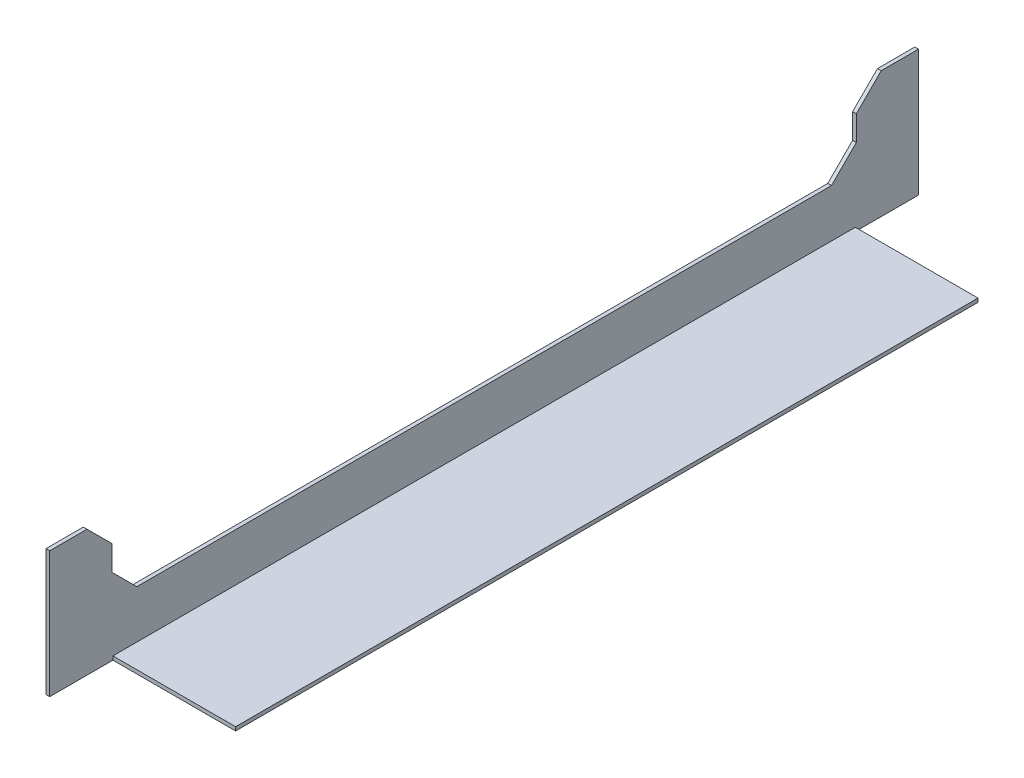
ISO-10303-21;
HEADER;
FILE_DESCRIPTION(('STEP AP214'),'2;1');
FILE_NAME('part.step','',(''),(''),'','','');
FILE_SCHEMA(('AUTOMOTIVE_DESIGN { 1 0 10303 214 1 1 1 1 }'));
ENDSEC;
DATA;
#1=APPLICATION_CONTEXT('core data for automotive mechanical design processes');
#2=APPLICATION_PROTOCOL_DEFINITION('international standard','automotive_design',2000,#1);
#3=PRODUCT_CONTEXT('',#1,'mechanical');
#4=PRODUCT('Part','Part','',(#3));
#5=PRODUCT_RELATED_PRODUCT_CATEGORY('part','',(#4));
#6=PRODUCT_DEFINITION_FORMATION('','',#4);
#7=PRODUCT_DEFINITION_CONTEXT('part definition',#1,'design');
#8=PRODUCT_DEFINITION('design','',#6,#7);
#9=PRODUCT_DEFINITION_SHAPE('','',#8);
#10=(LENGTH_UNIT() NAMED_UNIT(*) SI_UNIT(.MILLI.,.METRE.));
#11=(NAMED_UNIT(*) PLANE_ANGLE_UNIT() SI_UNIT($,.RADIAN.));
#12=(NAMED_UNIT(*) SI_UNIT($,.STERADIAN.) SOLID_ANGLE_UNIT());
#13=UNCERTAINTY_MEASURE_WITH_UNIT(LENGTH_MEASURE(1.E-05),#10,'distance_accuracy_value','');
#14=(GEOMETRIC_REPRESENTATION_CONTEXT(3) GLOBAL_UNCERTAINTY_ASSIGNED_CONTEXT((#13)) GLOBAL_UNIT_ASSIGNED_CONTEXT((#10,
#11,#12)) REPRESENTATION_CONTEXT('',''));
#15=CARTESIAN_POINT('',(0.,0.,0.));
#16=DIRECTION('',(0.,0.,1.));
#17=DIRECTION('',(1.,0.,0.));
#18=AXIS2_PLACEMENT_3D('',#15,#16,#17);
#19=CARTESIAN_POINT('',(1.50000000000006,50.8,349.2));
#20=DIRECTION('',(0.,-1.,0.));
#21=DIRECTION('',(0.,0.,-1.));
#22=AXIS2_PLACEMENT_3D('',#19,#20,#21);
#23=PLANE('',#22);
#24=DIRECTION('',(0.,0.,-1.));
#25=VECTOR('',#24,1.);
#26=CARTESIAN_POINT('',(1.50000000000006,50.8,349.2));
#27=LINE('',#26,#25);
#28=CARTESIAN_POINT('',(1.50000000000006,50.8,349.2));
#29=VERTEX_POINT('',#28);
#30=CARTESIAN_POINT('',(1.49999999999995,50.8,334.2));
#31=VERTEX_POINT('',#30);
#32=EDGE_CURVE('E180',#29,#31,#27,.T.);
#33=ORIENTED_EDGE('',*,*,#32,.T.);
#34=DIRECTION('',(-1.,0.,0.));
#35=VECTOR('',#34,1.);
#36=CARTESIAN_POINT('',(1.49999999999995,50.8,334.2));
#37=LINE('',#36,#35);
#38=CARTESIAN_POINT('',(0.,50.8,334.2));
#39=VERTEX_POINT('',#38);
#40=EDGE_CURVE('E202',#31,#39,#37,.T.);
#41=ORIENTED_EDGE('',*,*,#40,.T.);
#42=DIRECTION('',(0.,0.,-1.));
#43=VECTOR('',#42,1.);
#44=CARTESIAN_POINT('',(0.,50.8,349.2));
#45=LINE('',#44,#43);
#46=CARTESIAN_POINT('',(0.,50.8,349.2));
#47=VERTEX_POINT('',#46);
#48=EDGE_CURVE('E281',#47,#39,#45,.T.);
#49=ORIENTED_EDGE('',*,*,#48,.F.);
#50=DIRECTION('',(-1.,0.,0.));
#51=VECTOR('',#50,1.);
#52=CARTESIAN_POINT('',(1.50000000000006,50.8,349.2));
#53=LINE('',#52,#51);
#54=EDGE_CURVE('E264',#29,#47,#53,.T.);
#55=ORIENTED_EDGE('',*,*,#54,.F.);
#56=EDGE_LOOP('',(#33,#41,#49,#55));
#57=FACE_BOUND('',#56,.T.);
#58=ADVANCED_FACE('F36',(#57),#23,.F.);
#59=CARTESIAN_POINT('',(0.,0.,349.2));
#60=DIRECTION('',(0.,1.,0.));
#61=DIRECTION('',(0.,0.,1.));
#62=AXIS2_PLACEMENT_3D('',#59,#60,#61);
#63=PLANE('',#62);
#64=DIRECTION('',(-1.,0.,0.));
#65=VECTOR('',#64,1.);
#66=CARTESIAN_POINT('',(4.44089209850063E-13,0.,323.8));
#67=LINE('',#66,#65);
#68=CARTESIAN_POINT('',(50.8000000000004,0.,323.8));
#69=VERTEX_POINT('',#68);
#70=CARTESIAN_POINT('',(1.50000000000039,0.,323.8));
#71=VERTEX_POINT('',#70);
#72=EDGE_CURVE('E158',#69,#71,#67,.T.);
#73=ORIENTED_EDGE('',*,*,#72,.T.);
#74=DIRECTION('',(0.,0.,1.));
#75=VECTOR('',#74,1.);
#76=CARTESIAN_POINT('',(1.49999999999995,0.,349.2));
#77=LINE('',#76,#75);
#78=CARTESIAN_POINT('',(1.49999999999995,0.,349.2));
#79=VERTEX_POINT('',#78);
#80=EDGE_CURVE('E240',#71,#79,#77,.T.);
#81=ORIENTED_EDGE('',*,*,#80,.T.);
#82=DIRECTION('',(1.,0.,0.));
#83=VECTOR('',#82,1.);
#84=CARTESIAN_POINT('',(0.,0.,349.2));
#85=LINE('',#84,#83);
#86=CARTESIAN_POINT('',(0.,0.,349.2));
#87=VERTEX_POINT('',#86);
#88=EDGE_CURVE('E258',#87,#79,#85,.T.);
#89=ORIENTED_EDGE('',*,*,#88,.F.);
#90=DIRECTION('',(0.,0.,-1.));
#91=VECTOR('',#90,1.);
#92=CARTESIAN_POINT('',(0.,0.,349.2));
#93=LINE('',#92,#91);
#94=CARTESIAN_POINT('',(0.,0.,0.));
#95=VERTEX_POINT('',#94);
#96=EDGE_CURVE('E268',#87,#95,#93,.T.);
#97=ORIENTED_EDGE('',*,*,#96,.T.);
#98=DIRECTION('',(1.,0.,0.));
#99=VECTOR('',#98,1.);
#100=CARTESIAN_POINT('',(0.,0.,0.));
#101=LINE('',#100,#99);
#102=CARTESIAN_POINT('',(1.49999999999995,0.,2.22044604925031E-13));
#103=VERTEX_POINT('',#102);
#104=EDGE_CURVE('E257',#95,#103,#101,.T.);
#105=ORIENTED_EDGE('',*,*,#104,.T.);
#106=DIRECTION('',(0.,0.,1.));
#107=VECTOR('',#106,1.);
#108=CARTESIAN_POINT('',(1.50000000000006,0.,349.2));
#109=LINE('',#108,#107);
#110=CARTESIAN_POINT('',(1.50000000000006,0.,25.4000000000002));
#111=VERTEX_POINT('',#110);
#112=EDGE_CURVE('E249',#103,#111,#109,.T.);
#113=ORIENTED_EDGE('',*,*,#112,.T.);
#114=DIRECTION('',(1.,0.,0.));
#115=VECTOR('',#114,1.);
#116=CARTESIAN_POINT('',(0.,0.,25.4));
#117=LINE('',#116,#115);
#118=CARTESIAN_POINT('',(50.8000000000001,0.,25.4));
#119=VERTEX_POINT('',#118);
#120=EDGE_CURVE('E254',#111,#119,#117,.T.);
#121=ORIENTED_EDGE('',*,*,#120,.T.);
#122=DIRECTION('',(0.,0.,-1.));
#123=VECTOR('',#122,1.);
#124=CARTESIAN_POINT('',(50.8,0.,349.2));
#125=LINE('',#124,#123);
#126=EDGE_CURVE('E176',#69,#119,#125,.T.);
#127=ORIENTED_EDGE('',*,*,#126,.F.);
#128=EDGE_LOOP('',(#73,#81,#89,#97,#105,#113,#121,#127));
#129=FACE_BOUND('',#128,.T.);
#130=ADVANCED_FACE('F303',(#129),#63,.F.);
#131=CARTESIAN_POINT('',(50.8,1.5,349.2));
#132=DIRECTION('',(-1.,0.,0.));
#133=DIRECTION('',(0.,0.,1.));
#134=AXIS2_PLACEMENT_3D('',#131,#132,#133);
#135=PLANE('',#134);
#136=DIRECTION('',(0.,0.,-1.));
#137=VECTOR('',#136,1.);
#138=CARTESIAN_POINT('',(50.8,1.5,349.2));
#139=LINE('',#138,#137);
#140=CARTESIAN_POINT('',(50.8,1.5,323.8));
#141=VERTEX_POINT('',#140);
#142=CARTESIAN_POINT('',(50.8000000000002,1.5,25.4));
#143=VERTEX_POINT('',#142);
#144=EDGE_CURVE('E167',#141,#143,#139,.T.);
#145=ORIENTED_EDGE('',*,*,#144,.F.);
#146=DIRECTION('',(0.,1.,0.));
#147=VECTOR('',#146,1.);
#148=CARTESIAN_POINT('',(50.8000000000002,-0.5,323.8));
#149=LINE('',#148,#147);
#150=EDGE_CURVE('E151',#69,#141,#149,.T.);
#151=ORIENTED_EDGE('',*,*,#150,.F.);
#152=ORIENTED_EDGE('',*,*,#126,.T.);
#153=DIRECTION('',(0.,1.,0.));
#154=VECTOR('',#153,1.);
#155=CARTESIAN_POINT('',(50.8000000000001,-0.5,25.4));
#156=LINE('',#155,#154);
#157=EDGE_CURVE('E175',#119,#143,#156,.T.);
#158=ORIENTED_EDGE('',*,*,#157,.T.);
#159=EDGE_LOOP('',(#145,#151,#152,#158));
#160=FACE_BOUND('',#159,.T.);
#161=ADVANCED_FACE('F173',(#160),#135,.F.);
#162=CARTESIAN_POINT('',(1.50000000000006,1.5,349.2));
#163=DIRECTION('',(0.,-1.,0.));
#164=DIRECTION('',(0.,0.,-1.));
#165=AXIS2_PLACEMENT_3D('',#162,#163,#164);
#166=PLANE('',#165);
#167=DIRECTION('',(0.,0.,-1.));
#168=VECTOR('',#167,1.);
#169=CARTESIAN_POINT('',(1.50000000000006,1.5,349.2));
#170=LINE('',#169,#168);
#171=CARTESIAN_POINT('',(1.49999999999995,1.5,323.8));
#172=VERTEX_POINT('',#171);
#173=CARTESIAN_POINT('',(1.50000000000006,1.5,25.4000000000002));
#174=VERTEX_POINT('',#173);
#175=EDGE_CURVE('E169',#172,#174,#170,.T.);
#176=ORIENTED_EDGE('',*,*,#175,.F.);
#177=DIRECTION('',(-1.,0.,0.));
#178=VECTOR('',#177,1.);
#179=CARTESIAN_POINT('',(1.49999999999995,1.5,323.8));
#180=LINE('',#179,#178);
#181=EDGE_CURVE('E155',#141,#172,#180,.T.);
#182=ORIENTED_EDGE('',*,*,#181,.F.);
#183=ORIENTED_EDGE('',*,*,#144,.T.);
#184=DIRECTION('',(1.,0.,0.));
#185=VECTOR('',#184,1.);
#186=CARTESIAN_POINT('',(1.50000000000006,1.5,25.4000000000002));
#187=LINE('',#186,#185);
#188=EDGE_CURVE('E245',#174,#143,#187,.T.);
#189=ORIENTED_EDGE('',*,*,#188,.F.);
#190=EDGE_LOOP('',(#176,#182,#183,#189));
#191=FACE_BOUND('',#190,.T.);
#192=ADVANCED_FACE('F165',(#191),#166,.F.);
#193=CARTESIAN_POINT('',(1.50000000000006,1.5,349.2));
#194=DIRECTION('',(-1.,0.,0.));
#195=DIRECTION('',(0.,0.,1.));
#196=AXIS2_PLACEMENT_3D('',#193,#194,#195);
#197=PLANE('',#196);
#198=CARTESIAN_POINT('',(1.50000000000039,50.8,15.0000000000002));
#199=VERTEX_POINT('',#198);
#200=CARTESIAN_POINT('',(1.50000000000006,50.8,2.22044604925031E-13));
#201=VERTEX_POINT('',#200);
#202=EDGE_CURVE('E283',#199,#201,#27,.T.);
#203=ORIENTED_EDGE('',*,*,#202,.F.);
#204=DIRECTION('',(0.,0.707106781186548,-0.707106781186548));
#205=VECTOR('',#204,1.);
#206=CARTESIAN_POINT('',(1.49999999999995,40.7999999999999,25.0000000000002));
#207=LINE('',#206,#205);
#208=CARTESIAN_POINT('',(1.49999999999995,40.7999999999999,25.0000000000002));
#209=VERTEX_POINT('',#208);
#210=EDGE_CURVE('E195',#199,#209,#207,.F.);
#211=ORIENTED_EDGE('',*,*,#210,.T.);
#212=DIRECTION('',(0.,-1.,0.));
#213=VECTOR('',#212,1.);
#214=CARTESIAN_POINT('',(1.50000000000006,1.5,25.0000000000002));
#215=LINE('',#214,#213);
#216=CARTESIAN_POINT('',(1.50000000000006,30.8,25.0000000000002));
#217=VERTEX_POINT('',#216);
#218=EDGE_CURVE('E236',#209,#217,#215,.T.);
#219=ORIENTED_EDGE('',*,*,#218,.T.);
#220=DIRECTION('',(0.,0.707106781186544,-0.707106781186551));
#221=VECTOR('',#220,1.);
#222=CARTESIAN_POINT('',(1.49999999999995,-145.95,201.750000000002));
#223=LINE('',#222,#221);
#224=CARTESIAN_POINT('',(1.50000000000039,20.8,35.0000000000003));
#225=VERTEX_POINT('',#224);
#226=EDGE_CURVE('E211',#217,#225,#223,.F.);
#227=ORIENTED_EDGE('',*,*,#226,.T.);
#228=DIRECTION('',(0.,0.,1.));
#229=VECTOR('',#228,1.);
#230=CARTESIAN_POINT('',(1.50000000000006,20.8,349.2));
#231=LINE('',#230,#229);
#232=CARTESIAN_POINT('',(1.49999999999995,20.8,314.2));
#233=VERTEX_POINT('',#232);
#234=EDGE_CURVE('E233',#225,#233,#231,.T.);
#235=ORIENTED_EDGE('',*,*,#234,.T.);
#236=DIRECTION('',(0.,-0.707106781186551,-0.707106781186544));
#237=VECTOR('',#236,1.);
#238=CARTESIAN_POINT('',(1.50000000000006,28.6499999999999,322.05));
#239=LINE('',#238,#237);
#240=CARTESIAN_POINT('',(1.50000000000039,30.8000000000002,324.2));
#241=VERTEX_POINT('',#240);
#242=EDGE_CURVE('E11',#233,#241,#239,.F.);
#243=ORIENTED_EDGE('',*,*,#242,.T.);
#244=DIRECTION('',(0.,1.,0.));
#245=VECTOR('',#244,1.);
#246=CARTESIAN_POINT('',(1.49999999999995,1.5,324.2));
#247=LINE('',#246,#245);
#248=CARTESIAN_POINT('',(1.50000000000006,40.7999999999999,324.2));
#249=VERTEX_POINT('',#248);
#250=EDGE_CURVE('E170',#241,#249,#247,.T.);
#251=ORIENTED_EDGE('',*,*,#250,.T.);
#252=DIRECTION('',(0.,-0.707106781186549,-0.707106781186546));
#253=VECTOR('',#252,1.);
#254=CARTESIAN_POINT('',(1.49999999999995,50.8,334.2));
#255=LINE('',#254,#253);
#256=EDGE_CURVE('E51',#249,#31,#255,.F.);
#257=ORIENTED_EDGE('',*,*,#256,.T.);
#258=ORIENTED_EDGE('',*,*,#32,.F.);
#259=DIRECTION('',(0.,1.,0.));
#260=VECTOR('',#259,1.);
#261=CARTESIAN_POINT('',(1.50000000000006,1.5,349.2));
#262=LINE('',#261,#260);
#263=EDGE_CURVE('E261',#79,#29,#262,.T.);
#264=ORIENTED_EDGE('',*,*,#263,.F.);
#265=ORIENTED_EDGE('',*,*,#80,.F.);
#266=DIRECTION('',(0.,1.,0.));
#267=VECTOR('',#266,1.);
#268=CARTESIAN_POINT('',(1.50000000000039,-0.5,323.8));
#269=LINE('',#268,#267);
#270=EDGE_CURVE('E162',#71,#172,#269,.T.);
#271=ORIENTED_EDGE('',*,*,#270,.T.);
#272=ORIENTED_EDGE('',*,*,#175,.T.);
#273=DIRECTION('',(0.,1.,0.));
#274=VECTOR('',#273,1.);
#275=CARTESIAN_POINT('',(1.50000000000006,-0.5,25.4000000000002));
#276=LINE('',#275,#274);
#277=EDGE_CURVE('E247',#111,#174,#276,.T.);
#278=ORIENTED_EDGE('',*,*,#277,.F.);
#279=ORIENTED_EDGE('',*,*,#112,.F.);
#280=DIRECTION('',(0.,1.,0.));
#281=VECTOR('',#280,1.);
#282=CARTESIAN_POINT('',(1.50000000000006,1.5,2.22044604925031E-13));
#283=LINE('',#282,#281);
#284=EDGE_CURVE('E271',#103,#201,#283,.T.);
#285=ORIENTED_EDGE('',*,*,#284,.T.);
#286=EDGE_LOOP('',(#203,#211,#219,#227,#235,#243,#251,#257,#258,#264,#265,#271,#272,#278,#279,#285));
#287=FACE_BOUND('',#286,.T.);
#288=ADVANCED_FACE('F232',(#287),#197,.F.);
#289=CARTESIAN_POINT('',(4.44089209850063E-13,50.8,15.));
#290=VERTEX_POINT('',#289);
#291=CARTESIAN_POINT('',(0.,50.8,0.));
#292=VERTEX_POINT('',#291);
#293=EDGE_CURVE('E280',#290,#292,#45,.T.);
#294=ORIENTED_EDGE('',*,*,#293,.F.);
#295=DIRECTION('',(1.,0.,0.));
#296=VECTOR('',#295,1.);
#297=CARTESIAN_POINT('',(1.50000000000039,50.8,15.0000000000002));
#298=LINE('',#297,#296);
#299=EDGE_CURVE('E192',#290,#199,#298,.T.);
#300=ORIENTED_EDGE('',*,*,#299,.T.);
#301=ORIENTED_EDGE('',*,*,#202,.T.);
#302=DIRECTION('',(-1.,0.,0.));
#303=VECTOR('',#302,1.);
#304=CARTESIAN_POINT('',(1.50000000000006,50.8,2.22044604925031E-13));
#305=LINE('',#304,#303);
#306=EDGE_CURVE('E274',#201,#292,#305,.T.);
#307=ORIENTED_EDGE('',*,*,#306,.T.);
#308=EDGE_LOOP('',(#294,#300,#301,#307));
#309=FACE_BOUND('',#308,.T.);
#310=ADVANCED_FACE('F289',(#309),#23,.F.);
#311=CARTESIAN_POINT('',(0.,0.,349.2));
#312=DIRECTION('',(1.,0.,0.));
#313=DIRECTION('',(0.,0.,-1.));
#314=AXIS2_PLACEMENT_3D('',#311,#312,#313);
#315=PLANE('',#314);
#316=DIRECTION('',(0.,-1.,0.));
#317=VECTOR('',#316,1.);
#318=CARTESIAN_POINT('',(4.44089209850063E-13,50.8,25.));
#319=LINE('',#318,#317);
#320=CARTESIAN_POINT('',(0.,40.7999999999999,25.));
#321=VERTEX_POINT('',#320);
#322=CARTESIAN_POINT('',(0.,30.8,25.));
#323=VERTEX_POINT('',#322);
#324=EDGE_CURVE('E228',#321,#323,#319,.T.);
#325=ORIENTED_EDGE('',*,*,#324,.F.);
#326=DIRECTION('',(0.,-0.707106781186548,0.707106781186548));
#327=VECTOR('',#326,1.);
#328=CARTESIAN_POINT('',(0.,40.7999999999999,25.));
#329=LINE('',#328,#327);
#330=EDGE_CURVE('E190',#321,#290,#329,.F.);
#331=ORIENTED_EDGE('',*,*,#330,.T.);
#332=ORIENTED_EDGE('',*,*,#293,.T.);
#333=DIRECTION('',(0.,-1.,0.));
#334=VECTOR('',#333,1.);
#335=CARTESIAN_POINT('',(0.,0.,0.));
#336=LINE('',#335,#334);
#337=EDGE_CURVE('E262',#292,#95,#336,.T.);
#338=ORIENTED_EDGE('',*,*,#337,.T.);
#339=ORIENTED_EDGE('',*,*,#96,.F.);
#340=DIRECTION('',(0.,-1.,0.));
#341=VECTOR('',#340,1.);
#342=CARTESIAN_POINT('',(0.,0.,349.2));
#343=LINE('',#342,#341);
#344=EDGE_CURVE('E266',#47,#87,#343,.T.);
#345=ORIENTED_EDGE('',*,*,#344,.F.);
#346=ORIENTED_EDGE('',*,*,#48,.T.);
#347=DIRECTION('',(0.,0.707106781186549,0.707106781186546));
#348=VECTOR('',#347,1.);
#349=CARTESIAN_POINT('',(0.,50.8,334.2));
#350=LINE('',#349,#348);
#351=CARTESIAN_POINT('',(0.,40.7999999999999,324.2));
#352=VERTEX_POINT('',#351);
#353=EDGE_CURVE('E188',#39,#352,#350,.F.);
#354=ORIENTED_EDGE('',*,*,#353,.T.);
#355=DIRECTION('',(0.,1.,0.));
#356=VECTOR('',#355,1.);
#357=CARTESIAN_POINT('',(0.,50.8,324.2));
#358=LINE('',#357,#356);
#359=CARTESIAN_POINT('',(4.44089209850063E-13,30.8000000000002,324.2));
#360=VERTEX_POINT('',#359);
#361=EDGE_CURVE('E219',#360,#352,#358,.T.);
#362=ORIENTED_EDGE('',*,*,#361,.F.);
#363=DIRECTION('',(0.,0.707106781186551,0.707106781186544));
#364=VECTOR('',#363,1.);
#365=CARTESIAN_POINT('',(0.,27.8999999999999,321.3));
#366=LINE('',#365,#364);
#367=CARTESIAN_POINT('',(0.,20.8,314.2));
#368=VERTEX_POINT('',#367);
#369=EDGE_CURVE('E44',#360,#368,#366,.F.);
#370=ORIENTED_EDGE('',*,*,#369,.T.);
#371=DIRECTION('',(0.,0.,1.));
#372=VECTOR('',#371,1.);
#373=CARTESIAN_POINT('',(0.,20.8,324.2));
#374=LINE('',#373,#372);
#375=CARTESIAN_POINT('',(4.44089209850063E-13,20.8,35.0000000000001));
#376=VERTEX_POINT('',#375);
#377=EDGE_CURVE('E218',#376,#368,#374,.T.);
#378=ORIENTED_EDGE('',*,*,#377,.F.);
#379=DIRECTION('',(0.,-0.707106781186544,0.707106781186551));
#380=VECTOR('',#379,1.);
#381=CARTESIAN_POINT('',(0.,-146.7,202.500000000002));
#382=LINE('',#381,#380);
#383=EDGE_CURVE('E209',#376,#323,#382,.F.);
#384=ORIENTED_EDGE('',*,*,#383,.T.);
#385=EDGE_LOOP('',(#325,#331,#332,#338,#339,#345,#346,#354,#362,#370,#378,#384));
#386=FACE_BOUND('',#385,.T.);
#387=ADVANCED_FACE('F217',(#386),#315,.F.);
#388=CARTESIAN_POINT('',(0.,0.,349.2));
#389=DIRECTION('',(0.,0.,-1.));
#390=DIRECTION('',(-1.,0.,0.));
#391=AXIS2_PLACEMENT_3D('',#388,#389,#390);
#392=PLANE('',#391);
#393=ORIENTED_EDGE('',*,*,#88,.T.);
#394=ORIENTED_EDGE('',*,*,#263,.T.);
#395=ORIENTED_EDGE('',*,*,#54,.T.);
#396=ORIENTED_EDGE('',*,*,#344,.T.);
#397=EDGE_LOOP('',(#393,#394,#395,#396));
#398=FACE_BOUND('',#397,.T.);
#399=ADVANCED_FACE('F305',(#398),#392,.F.);
#400=CARTESIAN_POINT('',(0.,0.,0.));
#401=DIRECTION('',(0.,0.,-1.));
#402=DIRECTION('',(-1.,0.,0.));
#403=AXIS2_PLACEMENT_3D('',#400,#401,#402);
#404=PLANE('',#403);
#405=ORIENTED_EDGE('',*,*,#284,.F.);
#406=ORIENTED_EDGE('',*,*,#104,.F.);
#407=ORIENTED_EDGE('',*,*,#337,.F.);
#408=ORIENTED_EDGE('',*,*,#306,.F.);
#409=EDGE_LOOP('',(#405,#406,#407,#408));
#410=FACE_BOUND('',#409,.T.);
#411=ADVANCED_FACE('F298',(#410),#404,.T.);
#412=CARTESIAN_POINT('',(1.50000000000006,-0.5,25.4000000000002));
#413=DIRECTION('',(0.,0.,1.));
#414=DIRECTION('',(1.,0.,0.));
#415=AXIS2_PLACEMENT_3D('',#412,#413,#414);
#416=PLANE('',#415);
#417=ORIENTED_EDGE('',*,*,#277,.T.);
#418=ORIENTED_EDGE('',*,*,#188,.T.);
#419=ORIENTED_EDGE('',*,*,#157,.F.);
#420=ORIENTED_EDGE('',*,*,#120,.F.);
#421=EDGE_LOOP('',(#417,#418,#419,#420));
#422=FACE_BOUND('',#421,.T.);
#423=ADVANCED_FACE('F362',(#422),#416,.F.);
#424=CARTESIAN_POINT('',(1.50000000000039,-0.5,323.8));
#425=DIRECTION('',(0.,0.,-1.));
#426=DIRECTION('',(-1.,0.,0.));
#427=AXIS2_PLACEMENT_3D('',#424,#425,#426);
#428=PLANE('',#427);
#429=ORIENTED_EDGE('',*,*,#150,.T.);
#430=ORIENTED_EDGE('',*,*,#181,.T.);
#431=ORIENTED_EDGE('',*,*,#270,.F.);
#432=ORIENTED_EDGE('',*,*,#72,.F.);
#433=EDGE_LOOP('',(#429,#430,#431,#432));
#434=FACE_BOUND('',#433,.T.);
#435=ADVANCED_FACE('F153',(#434),#428,.F.);
#436=CARTESIAN_POINT('',(2.,50.8,324.2));
#437=DIRECTION('',(0.,0.,1.));
#438=DIRECTION('',(1.,0.,0.));
#439=AXIS2_PLACEMENT_3D('',#436,#437,#438);
#440=PLANE('',#439);
#441=ORIENTED_EDGE('',*,*,#361,.T.);
#442=DIRECTION('',(1.,0.,0.));
#443=VECTOR('',#442,1.);
#444=CARTESIAN_POINT('',(2.,40.7999999999999,324.2));
#445=LINE('',#444,#443);
#446=EDGE_CURVE('E59',#352,#249,#445,.T.);
#447=ORIENTED_EDGE('',*,*,#446,.T.);
#448=ORIENTED_EDGE('',*,*,#250,.F.);
#449=DIRECTION('',(-1.,0.,0.));
#450=VECTOR('',#449,1.);
#451=CARTESIAN_POINT('',(4.44089209850063E-13,30.8000000000002,324.2));
#452=LINE('',#451,#450);
#453=EDGE_CURVE('E205',#241,#360,#452,.T.);
#454=ORIENTED_EDGE('',*,*,#453,.T.);
#455=EDGE_LOOP('',(#441,#447,#448,#454));
#456=FACE_BOUND('',#455,.T.);
#457=ADVANCED_FACE('F234',(#456),#440,.F.);
#458=CARTESIAN_POINT('',(2.,20.8,324.2));
#459=DIRECTION('',(0.,-1.,0.));
#460=DIRECTION('',(0.,0.,-1.));
#461=AXIS2_PLACEMENT_3D('',#458,#459,#460);
#462=PLANE('',#461);
#463=ORIENTED_EDGE('',*,*,#234,.F.);
#464=DIRECTION('',(-1.,0.,0.));
#465=VECTOR('',#464,1.);
#466=CARTESIAN_POINT('',(4.44089209850063E-13,20.8,35.0000000000001));
#467=LINE('',#466,#465);
#468=EDGE_CURVE('E199',#225,#376,#467,.T.);
#469=ORIENTED_EDGE('',*,*,#468,.T.);
#470=ORIENTED_EDGE('',*,*,#377,.T.);
#471=DIRECTION('',(1.,0.,0.));
#472=VECTOR('',#471,1.);
#473=CARTESIAN_POINT('',(1.49999999999995,20.8,314.2));
#474=LINE('',#473,#472);
#475=EDGE_CURVE('E197',#368,#233,#474,.T.);
#476=ORIENTED_EDGE('',*,*,#475,.T.);
#477=EDGE_LOOP('',(#463,#469,#470,#476));
#478=FACE_BOUND('',#477,.T.);
#479=ADVANCED_FACE('F225',(#478),#462,.F.);
#480=CARTESIAN_POINT('',(2.00000000000045,50.8,25.0000000000002));
#481=DIRECTION('',(0.,0.,-1.));
#482=DIRECTION('',(-1.,0.,0.));
#483=AXIS2_PLACEMENT_3D('',#480,#481,#482);
#484=PLANE('',#483);
#485=ORIENTED_EDGE('',*,*,#218,.F.);
#486=DIRECTION('',(-1.,0.,0.));
#487=VECTOR('',#486,1.);
#488=CARTESIAN_POINT('',(2.,40.7999999999999,25.0000000000002));
#489=LINE('',#488,#487);
#490=EDGE_CURVE('E185',#209,#321,#489,.T.);
#491=ORIENTED_EDGE('',*,*,#490,.T.);
#492=ORIENTED_EDGE('',*,*,#324,.T.);
#493=DIRECTION('',(1.,0.,0.));
#494=VECTOR('',#493,1.);
#495=CARTESIAN_POINT('',(1.50000000000006,30.8,25.0000000000002));
#496=LINE('',#495,#494);
#497=EDGE_CURVE('E178',#323,#217,#496,.T.);
#498=ORIENTED_EDGE('',*,*,#497,.T.);
#499=EDGE_LOOP('',(#485,#491,#492,#498));
#500=FACE_BOUND('',#499,.T.);
#501=ADVANCED_FACE('F339',(#500),#484,.F.);
#502=CARTESIAN_POINT('',(2.,40.7999999999999,25.0000000000002));
#503=DIRECTION('',(0.,-0.707106781186547,-0.707106781186547));
#504=DIRECTION('',(-1.,0.,0.));
#505=AXIS2_PLACEMENT_3D('',#502,#503,#504);
#506=PLANE('',#505);
#507=ORIENTED_EDGE('',*,*,#210,.F.);
#508=ORIENTED_EDGE('',*,*,#299,.F.);
#509=ORIENTED_EDGE('',*,*,#330,.F.);
#510=ORIENTED_EDGE('',*,*,#490,.F.);
#511=EDGE_LOOP('',(#507,#508,#509,#510));
#512=FACE_BOUND('',#511,.T.);
#513=ADVANCED_FACE('F315',(#512),#506,.F.);
#514=CARTESIAN_POINT('',(2.00000000000045,20.8,35.0000000000003));
#515=DIRECTION('',(0.,0.707106781186551,0.707106781186544));
#516=DIRECTION('',(1.,0.,0.));
#517=AXIS2_PLACEMENT_3D('',#514,#515,#516);
#518=PLANE('',#517);
#519=ORIENTED_EDGE('',*,*,#226,.F.);
#520=ORIENTED_EDGE('',*,*,#497,.F.);
#521=ORIENTED_EDGE('',*,*,#383,.F.);
#522=ORIENTED_EDGE('',*,*,#468,.F.);
#523=EDGE_LOOP('',(#519,#520,#521,#522));
#524=FACE_BOUND('',#523,.T.);
#525=ADVANCED_FACE('F310',(#524),#518,.T.);
#526=CARTESIAN_POINT('',(1.49999999999995,50.8,334.2));
#527=DIRECTION('',(0.,-0.707106781186545,0.707106781186549));
#528=DIRECTION('',(-1.,0.,0.));
#529=AXIS2_PLACEMENT_3D('',#526,#527,#528);
#530=PLANE('',#529);
#531=ORIENTED_EDGE('',*,*,#256,.F.);
#532=ORIENTED_EDGE('',*,*,#446,.F.);
#533=ORIENTED_EDGE('',*,*,#353,.F.);
#534=ORIENTED_EDGE('',*,*,#40,.F.);
#535=EDGE_LOOP('',(#531,#532,#533,#534));
#536=FACE_BOUND('',#535,.T.);
#537=ADVANCED_FACE('F308',(#536),#530,.F.);
#538=CARTESIAN_POINT('',(2.00000000000045,30.8000000000002,324.2));
#539=DIRECTION('',(0.,0.707106781186543,-0.707106781186551));
#540=DIRECTION('',(1.,0.,0.));
#541=AXIS2_PLACEMENT_3D('',#538,#539,#540);
#542=PLANE('',#541);
#543=ORIENTED_EDGE('',*,*,#242,.F.);
#544=ORIENTED_EDGE('',*,*,#475,.F.);
#545=ORIENTED_EDGE('',*,*,#369,.F.);
#546=ORIENTED_EDGE('',*,*,#453,.F.);
#547=EDGE_LOOP('',(#543,#544,#545,#546));
#548=FACE_BOUND('',#547,.T.);
#549=ADVANCED_FACE('F38',(#548),#542,.T.);
#550=CLOSED_SHELL('',(#58,#130,#161,#192,#288,#310,#387,#399,#411,#423,#435,#457,#479,#501,#513,
#525,#537,#549));
#551=MANIFOLD_SOLID_BREP('B2',#550);
#552=ADVANCED_BREP_SHAPE_REPRESENTATION('',(#18,#551),#14);
#553=SHAPE_DEFINITION_REPRESENTATION(#9,#552);
ENDSEC;
END-ISO-10303-21;
